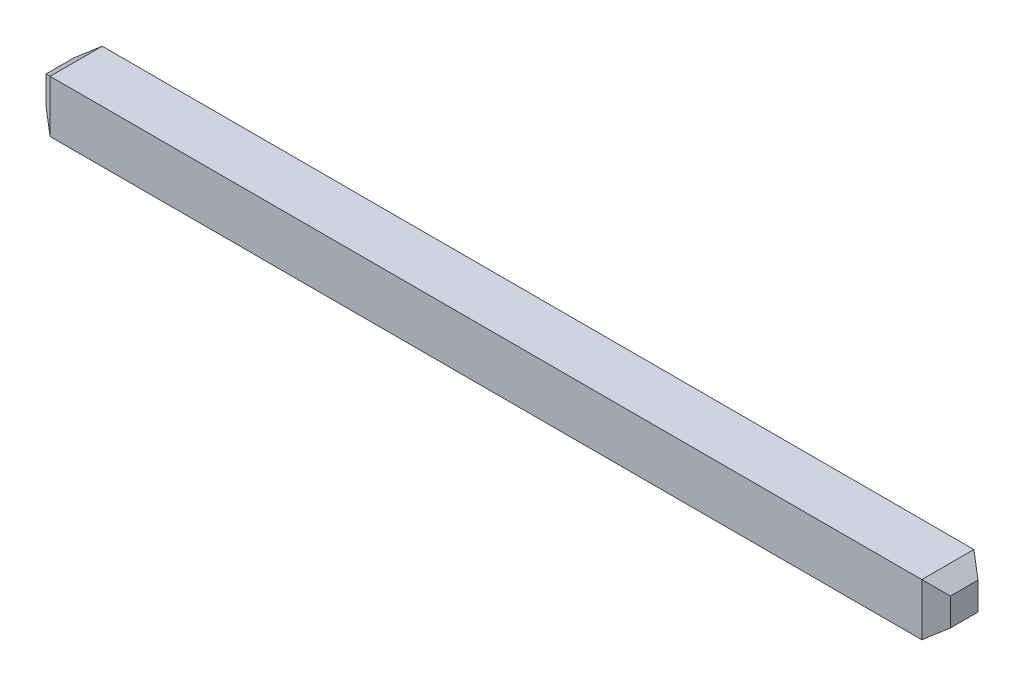
ISO-10303-21;
HEADER;
FILE_DESCRIPTION(('STEP AP214'),'2;1');
FILE_NAME('part.step','',(''),(''),'','','');
FILE_SCHEMA(('AUTOMOTIVE_DESIGN { 1 0 10303 214 1 1 1 1 }'));
ENDSEC;
DATA;
#1=APPLICATION_CONTEXT('core data for automotive mechanical design processes');
#2=APPLICATION_PROTOCOL_DEFINITION('international standard','automotive_design',2000,#1);
#3=PRODUCT_CONTEXT('',#1,'mechanical');
#4=PRODUCT('Part','Part','',(#3));
#5=PRODUCT_RELATED_PRODUCT_CATEGORY('part','',(#4));
#6=PRODUCT_DEFINITION_FORMATION('','',#4);
#7=PRODUCT_DEFINITION_CONTEXT('part definition',#1,'design');
#8=PRODUCT_DEFINITION('design','',#6,#7);
#9=PRODUCT_DEFINITION_SHAPE('','',#8);
#10=(LENGTH_UNIT() NAMED_UNIT(*) SI_UNIT(.MILLI.,.METRE.));
#11=(NAMED_UNIT(*) PLANE_ANGLE_UNIT() SI_UNIT($,.RADIAN.));
#12=(NAMED_UNIT(*) SI_UNIT($,.STERADIAN.) SOLID_ANGLE_UNIT());
#13=UNCERTAINTY_MEASURE_WITH_UNIT(LENGTH_MEASURE(1.E-05),#10,'distance_accuracy_value','');
#14=(GEOMETRIC_REPRESENTATION_CONTEXT(3) GLOBAL_UNCERTAINTY_ASSIGNED_CONTEXT((#13)) GLOBAL_UNIT_ASSIGNED_CONTEXT((#10,
#11,#12)) REPRESENTATION_CONTEXT('',''));
#15=CARTESIAN_POINT('',(0.,0.,0.));
#16=DIRECTION('',(0.,0.,1.));
#17=DIRECTION('',(1.,0.,0.));
#18=AXIS2_PLACEMENT_3D('',#15,#16,#17);
#19=CARTESIAN_POINT('',(-2.4,3.525,-8.89));
#20=DIRECTION('',(0.6,0.8,0.));
#21=DIRECTION('',(-0.8,0.6,0.));
#22=AXIS2_PLACEMENT_3D('',#19,#20,#21);
#23=PLANE('',#22);
#24=DIRECTION('',(0.,0.,1.));
#25=VECTOR('',#24,1.);
#26=CARTESIAN_POINT('',(-2.3,3.45,-8.89));
#27=LINE('',#26,#25);
#28=CARTESIAN_POINT('',(-2.3,3.45,-9.21));
#29=VERTEX_POINT('',#28);
#30=CARTESIAN_POINT('',(-2.3,3.45,-8.57));
#31=VERTEX_POINT('',#30);
#32=EDGE_CURVE('E105',#29,#31,#27,.T.);
#33=ORIENTED_EDGE('',*,*,#32,.T.);
#34=DIRECTION('',(0.685994340570035,-0.514495755427528,0.514495755427525));
#35=VECTOR('',#34,1.);
#36=CARTESIAN_POINT('',(-2.5,3.6,-8.72));
#37=LINE('',#36,#35);
#38=CARTESIAN_POINT('',(-2.5,3.6,-8.72));
#39=VERTEX_POINT('',#38);
#40=EDGE_CURVE('E92',#39,#31,#37,.T.);
#41=ORIENTED_EDGE('',*,*,#40,.F.);
#42=DIRECTION('',(0.,0.,-1.));
#43=VECTOR('',#42,1.);
#44=CARTESIAN_POINT('',(-2.5,3.6,-8.89));
#45=LINE('',#44,#43);
#46=CARTESIAN_POINT('',(-2.5,3.6,-9.06));
#47=VERTEX_POINT('',#46);
#48=EDGE_CURVE('E79',#39,#47,#45,.T.);
#49=ORIENTED_EDGE('',*,*,#48,.T.);
#50=DIRECTION('',(0.685994340570035,-0.514495755427525,-0.514495755427528));
#51=VECTOR('',#50,1.);
#52=CARTESIAN_POINT('',(-2.5,3.6,-9.06));
#53=LINE('',#52,#51);
#54=EDGE_CURVE('E20',#47,#29,#53,.T.);
#55=ORIENTED_EDGE('',*,*,#54,.T.);
#56=EDGE_LOOP('',(#33,#41,#49,#55));
#57=FACE_BOUND('',#56,.T.);
#58=ADVANCED_FACE('F17',(#57),#23,.F.);
#59=CARTESIAN_POINT('',(8.5,3.525,-8.89));
#60=DIRECTION('',(-0.6,0.8,0.));
#61=DIRECTION('',(-0.8,-0.6,0.));
#62=AXIS2_PLACEMENT_3D('',#59,#60,#61);
#63=PLANE('',#62);
#64=DIRECTION('',(0.,0.,-1.));
#65=VECTOR('',#64,1.);
#66=CARTESIAN_POINT('',(8.6,3.6,-8.89));
#67=LINE('',#66,#65);
#68=CARTESIAN_POINT('',(8.6,3.6,-8.72));
#69=VERTEX_POINT('',#68);
#70=CARTESIAN_POINT('',(8.6,3.6,-9.06));
#71=VERTEX_POINT('',#70);
#72=EDGE_CURVE('E114',#69,#71,#67,.T.);
#73=ORIENTED_EDGE('',*,*,#72,.F.);
#74=DIRECTION('',(0.685994340570034,0.514495755427529,-0.514495755427526));
#75=VECTOR('',#74,1.);
#76=CARTESIAN_POINT('',(8.4,3.45,-8.57));
#77=LINE('',#76,#75);
#78=CARTESIAN_POINT('',(8.4,3.45,-8.57));
#79=VERTEX_POINT('',#78);
#80=EDGE_CURVE('E109',#79,#69,#77,.T.);
#81=ORIENTED_EDGE('',*,*,#80,.F.);
#82=DIRECTION('',(0.,0.,1.));
#83=VECTOR('',#82,1.);
#84=CARTESIAN_POINT('',(8.4,3.45,-8.89));
#85=LINE('',#84,#83);
#86=CARTESIAN_POINT('',(8.4,3.45,-9.21));
#87=VERTEX_POINT('',#86);
#88=EDGE_CURVE('E103',#79,#87,#85,.F.);
#89=ORIENTED_EDGE('',*,*,#88,.T.);
#90=DIRECTION('',(0.685994340570032,0.514495755427527,0.51449575542753));
#91=VECTOR('',#90,1.);
#92=CARTESIAN_POINT('',(8.4,3.45,-9.21));
#93=LINE('',#92,#91);
#94=EDGE_CURVE('E107',#87,#71,#93,.T.);
#95=ORIENTED_EDGE('',*,*,#94,.T.);
#96=EDGE_LOOP('',(#73,#81,#89,#95));
#97=FACE_BOUND('',#96,.T.);
#98=ADVANCED_FACE('F175',(#97),#63,.F.);
#99=CARTESIAN_POINT('',(-2.4,3.77,-9.135));
#100=DIRECTION('',(0.6,0.,0.8));
#101=DIRECTION('',(0.8,0.,-0.6));
#102=AXIS2_PLACEMENT_3D('',#99,#100,#101);
#103=PLANE('',#102);
#104=DIRECTION('',(0.,1.,0.));
#105=VECTOR('',#104,1.);
#106=CARTESIAN_POINT('',(-2.3,3.77,-9.21));
#107=LINE('',#106,#105);
#108=CARTESIAN_POINT('',(-2.3,4.09,-9.21));
#109=VERTEX_POINT('',#108);
#110=EDGE_CURVE('E88',#109,#29,#107,.F.);
#111=ORIENTED_EDGE('',*,*,#110,.T.);
#112=ORIENTED_EDGE('',*,*,#54,.F.);
#113=DIRECTION('',(0.,1.,0.));
#114=VECTOR('',#113,1.);
#115=CARTESIAN_POINT('',(-2.5,3.77,-9.06));
#116=LINE('',#115,#114);
#117=CARTESIAN_POINT('',(-2.5,3.94,-9.06));
#118=VERTEX_POINT('',#117);
#119=EDGE_CURVE('E85',#47,#118,#116,.T.);
#120=ORIENTED_EDGE('',*,*,#119,.T.);
#121=DIRECTION('',(-0.685994340570035,-0.514495755427526,0.514495755427529));
#122=VECTOR('',#121,1.);
#123=CARTESIAN_POINT('',(-2.3,4.09,-9.21));
#124=LINE('',#123,#122);
#125=EDGE_CURVE('E126',#109,#118,#124,.T.);
#126=ORIENTED_EDGE('',*,*,#125,.F.);
#127=EDGE_LOOP('',(#111,#112,#120,#126));
#128=FACE_BOUND('',#127,.T.);
#129=ADVANCED_FACE('F84',(#128),#103,.F.);
#130=CARTESIAN_POINT('',(-2.5,3.77,-8.89));
#131=DIRECTION('',(1.,0.,0.));
#132=DIRECTION('',(0.,0.,-1.));
#133=AXIS2_PLACEMENT_3D('',#130,#131,#132);
#134=PLANE('',#133);
#135=DIRECTION('',(0.,1.,0.));
#136=VECTOR('',#135,1.);
#137=CARTESIAN_POINT('',(-2.5,3.77,-8.72));
#138=LINE('',#137,#136);
#139=CARTESIAN_POINT('',(-2.5,3.94,-8.72));
#140=VERTEX_POINT('',#139);
#141=EDGE_CURVE('E94',#140,#39,#138,.F.);
#142=ORIENTED_EDGE('',*,*,#141,.F.);
#143=DIRECTION('',(0.,0.,1.));
#144=VECTOR('',#143,1.);
#145=CARTESIAN_POINT('',(-2.5,3.94,-8.89));
#146=LINE('',#145,#144);
#147=EDGE_CURVE('E98',#118,#140,#146,.T.);
#148=ORIENTED_EDGE('',*,*,#147,.F.);
#149=ORIENTED_EDGE('',*,*,#119,.F.);
#150=ORIENTED_EDGE('',*,*,#48,.F.);
#151=EDGE_LOOP('',(#142,#148,#149,#150));
#152=FACE_BOUND('',#151,.T.);
#153=ADVANCED_FACE('F96',(#152),#134,.F.);
#154=CARTESIAN_POINT('',(-2.4,3.77,-8.645));
#155=DIRECTION('',(-0.6,0.,0.8));
#156=DIRECTION('',(0.8,0.,0.6));
#157=AXIS2_PLACEMENT_3D('',#154,#155,#156);
#158=PLANE('',#157);
#159=ORIENTED_EDGE('',*,*,#40,.T.);
#160=DIRECTION('',(0.,1.,0.));
#161=VECTOR('',#160,1.);
#162=CARTESIAN_POINT('',(-2.3,3.77,-8.57));
#163=LINE('',#162,#161);
#164=CARTESIAN_POINT('',(-2.3,4.09,-8.57));
#165=VERTEX_POINT('',#164);
#166=EDGE_CURVE('E132',#165,#31,#163,.F.);
#167=ORIENTED_EDGE('',*,*,#166,.F.);
#168=DIRECTION('',(0.685994340570037,0.514495755427527,0.514495755427524));
#169=VECTOR('',#168,1.);
#170=CARTESIAN_POINT('',(-2.5,3.94,-8.72));
#171=LINE('',#170,#169);
#172=EDGE_CURVE('E129',#140,#165,#171,.T.);
#173=ORIENTED_EDGE('',*,*,#172,.F.);
#174=ORIENTED_EDGE('',*,*,#141,.T.);
#175=EDGE_LOOP('',(#159,#167,#173,#174));
#176=FACE_BOUND('',#175,.T.);
#177=ADVANCED_FACE('F186',(#176),#158,.T.);
#178=CARTESIAN_POINT('',(3.05,3.45,-8.89));
#179=DIRECTION('',(0.,1.,0.));
#180=DIRECTION('',(0.,0.,1.));
#181=AXIS2_PLACEMENT_3D('',#178,#179,#180);
#182=PLANE('',#181);
#183=ORIENTED_EDGE('',*,*,#32,.F.);
#184=DIRECTION('',(1.,0.,0.));
#185=VECTOR('',#184,1.);
#186=CARTESIAN_POINT('',(3.05,3.45,-9.21));
#187=LINE('',#186,#185);
#188=EDGE_CURVE('E123',#29,#87,#187,.T.);
#189=ORIENTED_EDGE('',*,*,#188,.T.);
#190=ORIENTED_EDGE('',*,*,#88,.F.);
#191=DIRECTION('',(1.,0.,0.));
#192=VECTOR('',#191,1.);
#193=CARTESIAN_POINT('',(3.05,3.45,-8.57));
#194=LINE('',#193,#192);
#195=EDGE_CURVE('E135',#31,#79,#194,.T.);
#196=ORIENTED_EDGE('',*,*,#195,.F.);
#197=EDGE_LOOP('',(#183,#189,#190,#196));
#198=FACE_BOUND('',#197,.T.);
#199=ADVANCED_FACE('F179',(#198),#182,.F.);
#200=CARTESIAN_POINT('',(8.5,3.77,-9.135));
#201=DIRECTION('',(-0.6,0.,0.8));
#202=DIRECTION('',(0.8,0.,0.6));
#203=AXIS2_PLACEMENT_3D('',#200,#201,#202);
#204=PLANE('',#203);
#205=DIRECTION('',(0.,1.,0.));
#206=VECTOR('',#205,1.);
#207=CARTESIAN_POINT('',(8.6,3.77,-9.06));
#208=LINE('',#207,#206);
#209=CARTESIAN_POINT('',(8.6,3.94,-9.06));
#210=VERTEX_POINT('',#209);
#211=EDGE_CURVE('E117',#71,#210,#208,.T.);
#212=ORIENTED_EDGE('',*,*,#211,.F.);
#213=ORIENTED_EDGE('',*,*,#94,.F.);
#214=DIRECTION('',(0.,1.,0.));
#215=VECTOR('',#214,1.);
#216=CARTESIAN_POINT('',(8.4,3.77,-9.21));
#217=LINE('',#216,#215);
#218=CARTESIAN_POINT('',(8.4,4.09,-9.21));
#219=VERTEX_POINT('',#218);
#220=EDGE_CURVE('E120',#87,#219,#217,.T.);
#221=ORIENTED_EDGE('',*,*,#220,.T.);
#222=DIRECTION('',(-0.685994340570033,0.514495755427525,-0.514495755427531));
#223=VECTOR('',#222,1.);
#224=CARTESIAN_POINT('',(8.6,3.94,-9.06));
#225=LINE('',#224,#223);
#226=EDGE_CURVE('E140',#210,#219,#225,.T.);
#227=ORIENTED_EDGE('',*,*,#226,.F.);
#228=EDGE_LOOP('',(#212,#213,#221,#227));
#229=FACE_BOUND('',#228,.T.);
#230=ADVANCED_FACE('F167',(#229),#204,.F.);
#231=CARTESIAN_POINT('',(8.5,3.77,-8.645));
#232=DIRECTION('',(0.6,0.,0.8));
#233=DIRECTION('',(0.8,0.,-0.6));
#234=AXIS2_PLACEMENT_3D('',#231,#232,#233);
#235=PLANE('',#234);
#236=DIRECTION('',(0.685994340570035,-0.514495755427526,-0.514495755427526));
#237=VECTOR('',#236,1.);
#238=CARTESIAN_POINT('',(8.4,4.09,-8.57));
#239=LINE('',#238,#237);
#240=CARTESIAN_POINT('',(8.4,4.09,-8.57));
#241=VERTEX_POINT('',#240);
#242=CARTESIAN_POINT('',(8.6,3.94,-8.72));
#243=VERTEX_POINT('',#242);
#244=EDGE_CURVE('E35',#241,#243,#239,.T.);
#245=ORIENTED_EDGE('',*,*,#244,.F.);
#246=DIRECTION('',(0.,1.,0.));
#247=VECTOR('',#246,1.);
#248=CARTESIAN_POINT('',(8.4,3.77,-8.57));
#249=LINE('',#248,#247);
#250=EDGE_CURVE('E138',#79,#241,#249,.T.);
#251=ORIENTED_EDGE('',*,*,#250,.F.);
#252=ORIENTED_EDGE('',*,*,#80,.T.);
#253=DIRECTION('',(0.,1.,0.));
#254=VECTOR('',#253,1.);
#255=CARTESIAN_POINT('',(8.6,3.77,-8.72));
#256=LINE('',#255,#254);
#257=EDGE_CURVE('E111',#243,#69,#256,.F.);
#258=ORIENTED_EDGE('',*,*,#257,.F.);
#259=EDGE_LOOP('',(#245,#251,#252,#258));
#260=FACE_BOUND('',#259,.T.);
#261=ADVANCED_FACE('F211',(#260),#235,.T.);
#262=CARTESIAN_POINT('',(8.6,3.77,-8.89));
#263=DIRECTION('',(1.,0.,0.));
#264=DIRECTION('',(0.,0.,-1.));
#265=AXIS2_PLACEMENT_3D('',#262,#263,#264);
#266=PLANE('',#265);
#267=ORIENTED_EDGE('',*,*,#211,.T.);
#268=DIRECTION('',(0.,0.,1.));
#269=VECTOR('',#268,1.);
#270=CARTESIAN_POINT('',(8.6,3.94,-8.89));
#271=LINE('',#270,#269);
#272=EDGE_CURVE('E144',#243,#210,#271,.F.);
#273=ORIENTED_EDGE('',*,*,#272,.F.);
#274=ORIENTED_EDGE('',*,*,#257,.T.);
#275=ORIENTED_EDGE('',*,*,#72,.T.);
#276=EDGE_LOOP('',(#267,#273,#274,#275));
#277=FACE_BOUND('',#276,.T.);
#278=ADVANCED_FACE('F172',(#277),#266,.T.);
#279=CARTESIAN_POINT('',(3.05,3.77,-9.21));
#280=DIRECTION('',(0.,0.,1.));
#281=DIRECTION('',(1.,0.,0.));
#282=AXIS2_PLACEMENT_3D('',#279,#280,#281);
#283=PLANE('',#282);
#284=ORIENTED_EDGE('',*,*,#110,.F.);
#285=DIRECTION('',(1.,0.,0.));
#286=VECTOR('',#285,1.);
#287=CARTESIAN_POINT('',(3.05,4.09,-9.21));
#288=LINE('',#287,#286);
#289=EDGE_CURVE('E147',#219,#109,#288,.F.);
#290=ORIENTED_EDGE('',*,*,#289,.F.);
#291=ORIENTED_EDGE('',*,*,#220,.F.);
#292=ORIENTED_EDGE('',*,*,#188,.F.);
#293=EDGE_LOOP('',(#284,#290,#291,#292));
#294=FACE_BOUND('',#293,.T.);
#295=ADVANCED_FACE('F181',(#294),#283,.F.);
#296=CARTESIAN_POINT('',(-2.4,4.015,-8.89));
#297=DIRECTION('',(-0.6,0.8,0.));
#298=DIRECTION('',(-0.8,-0.6,0.));
#299=AXIS2_PLACEMENT_3D('',#296,#297,#298);
#300=PLANE('',#299);
#301=ORIENTED_EDGE('',*,*,#172,.T.);
#302=DIRECTION('',(0.,0.,1.));
#303=VECTOR('',#302,1.);
#304=CARTESIAN_POINT('',(-2.3,4.09,-8.89));
#305=LINE('',#304,#303);
#306=EDGE_CURVE('E150',#109,#165,#305,.T.);
#307=ORIENTED_EDGE('',*,*,#306,.F.);
#308=ORIENTED_EDGE('',*,*,#125,.T.);
#309=ORIENTED_EDGE('',*,*,#147,.T.);
#310=EDGE_LOOP('',(#301,#307,#308,#309));
#311=FACE_BOUND('',#310,.T.);
#312=ADVANCED_FACE('F183',(#311),#300,.T.);
#313=CARTESIAN_POINT('',(3.05,3.77,-8.57));
#314=DIRECTION('',(0.,0.,1.));
#315=DIRECTION('',(1.,0.,0.));
#316=AXIS2_PLACEMENT_3D('',#313,#314,#315);
#317=PLANE('',#316);
#318=ORIENTED_EDGE('',*,*,#195,.T.);
#319=ORIENTED_EDGE('',*,*,#250,.T.);
#320=DIRECTION('',(1.,0.,0.));
#321=VECTOR('',#320,1.);
#322=CARTESIAN_POINT('',(3.05,4.09,-8.57));
#323=LINE('',#322,#321);
#324=EDGE_CURVE('E26',#165,#241,#323,.T.);
#325=ORIENTED_EDGE('',*,*,#324,.F.);
#326=ORIENTED_EDGE('',*,*,#166,.T.);
#327=EDGE_LOOP('',(#318,#319,#325,#326));
#328=FACE_BOUND('',#327,.T.);
#329=ADVANCED_FACE('F160',(#328),#317,.T.);
#330=CARTESIAN_POINT('',(8.5,4.015,-8.89));
#331=DIRECTION('',(0.6,0.8,0.));
#332=DIRECTION('',(-0.8,0.6,0.));
#333=AXIS2_PLACEMENT_3D('',#330,#331,#332);
#334=PLANE('',#333);
#335=ORIENTED_EDGE('',*,*,#244,.T.);
#336=ORIENTED_EDGE('',*,*,#272,.T.);
#337=ORIENTED_EDGE('',*,*,#226,.T.);
#338=DIRECTION('',(0.,0.,1.));
#339=VECTOR('',#338,1.);
#340=CARTESIAN_POINT('',(8.4,4.09,-8.89));
#341=LINE('',#340,#339);
#342=EDGE_CURVE('E11',#241,#219,#341,.F.);
#343=ORIENTED_EDGE('',*,*,#342,.F.);
#344=EDGE_LOOP('',(#335,#336,#337,#343));
#345=FACE_BOUND('',#344,.T.);
#346=ADVANCED_FACE('F163',(#345),#334,.T.);
#347=CARTESIAN_POINT('',(3.05,4.09,-8.89));
#348=DIRECTION('',(0.,1.,0.));
#349=DIRECTION('',(0.,0.,1.));
#350=AXIS2_PLACEMENT_3D('',#347,#348,#349);
#351=PLANE('',#350);
#352=ORIENTED_EDGE('',*,*,#324,.T.);
#353=ORIENTED_EDGE('',*,*,#342,.T.);
#354=ORIENTED_EDGE('',*,*,#289,.T.);
#355=ORIENTED_EDGE('',*,*,#306,.T.);
#356=EDGE_LOOP('',(#352,#353,#354,#355));
#357=FACE_BOUND('',#356,.T.);
#358=ADVANCED_FACE('F156',(#357),#351,.T.);
#359=CLOSED_SHELL('',(#58,#98,#129,#153,#177,#199,#230,#261,#278,#295,#312,#329,#346,#358));
#360=MANIFOLD_SOLID_BREP('B1',#359);
#361=ADVANCED_BREP_SHAPE_REPRESENTATION('',(#18,#360),#14);
#362=SHAPE_DEFINITION_REPRESENTATION(#9,#361);
ENDSEC;
END-ISO-10303-21;
